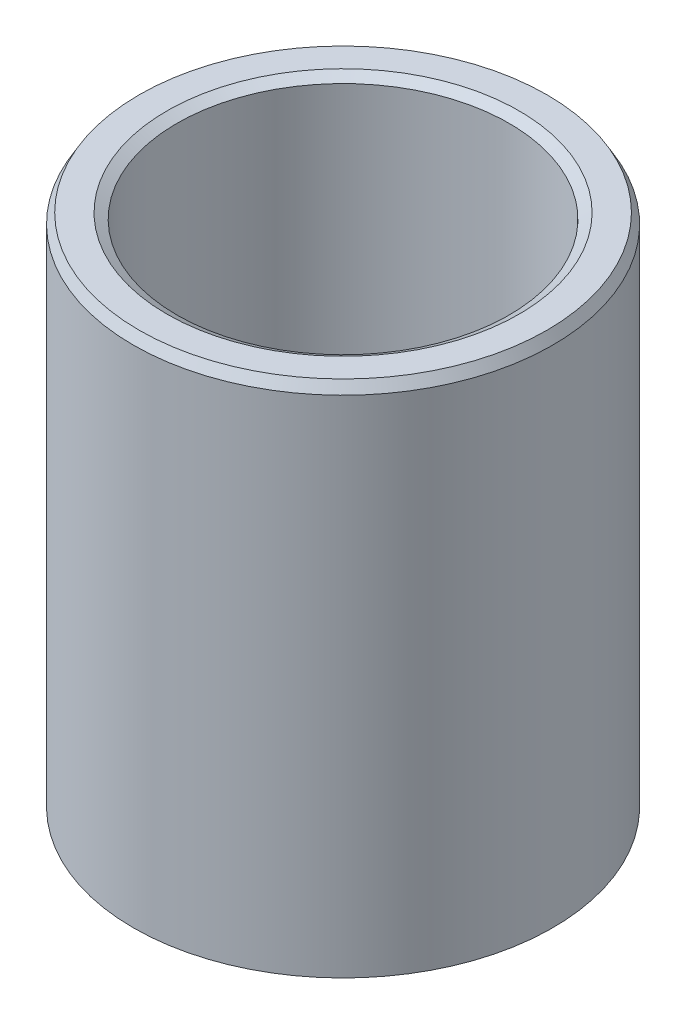
ISO-10303-21;
HEADER;
FILE_DESCRIPTION(('STEP AP214'),'2;1');
FILE_NAME('part.step','',(''),(''),'','','');
FILE_SCHEMA(('AUTOMOTIVE_DESIGN { 1 0 10303 214 1 1 1 1 }'));
ENDSEC;
DATA;
#1=APPLICATION_CONTEXT('core data for automotive mechanical design processes');
#2=APPLICATION_PROTOCOL_DEFINITION('international standard','automotive_design',2000,#1);
#3=PRODUCT_CONTEXT('',#1,'mechanical');
#4=PRODUCT('Part','Part','',(#3));
#5=PRODUCT_RELATED_PRODUCT_CATEGORY('part','',(#4));
#6=PRODUCT_DEFINITION_FORMATION('','',#4);
#7=PRODUCT_DEFINITION_CONTEXT('part definition',#1,'design');
#8=PRODUCT_DEFINITION('design','',#6,#7);
#9=PRODUCT_DEFINITION_SHAPE('','',#8);
#10=(LENGTH_UNIT() NAMED_UNIT(*) SI_UNIT(.MILLI.,.METRE.));
#11=(NAMED_UNIT(*) PLANE_ANGLE_UNIT() SI_UNIT($,.RADIAN.));
#12=(NAMED_UNIT(*) SI_UNIT($,.STERADIAN.) SOLID_ANGLE_UNIT());
#13=UNCERTAINTY_MEASURE_WITH_UNIT(LENGTH_MEASURE(1.E-05),#10,'distance_accuracy_value','');
#14=(GEOMETRIC_REPRESENTATION_CONTEXT(3) GLOBAL_UNCERTAINTY_ASSIGNED_CONTEXT((#13)) GLOBAL_UNIT_ASSIGNED_CONTEXT((#10,
#11,#12)) REPRESENTATION_CONTEXT('',''));
#15=CARTESIAN_POINT('',(0.,0.,0.));
#16=DIRECTION('',(0.,0.,1.));
#17=DIRECTION('',(1.,0.,0.));
#18=AXIS2_PLACEMENT_3D('',#15,#16,#17);
#19=CARTESIAN_POINT('',(0.,43.4328632835127,0.));
#20=DIRECTION('',(0.,-1.,0.));
#21=DIRECTION('',(0.,0.,-1.));
#22=AXIS2_PLACEMENT_3D('',#19,#20,#21);
#23=CYLINDRICAL_SURFACE('',#22,17.5);
#24=CARTESIAN_POINT('',(0.,0.482095603221468,0.));
#25=DIRECTION('',(0.,1.,0.));
#26=DIRECTION('',(0.,0.,1.));
#27=AXIS2_PLACEMENT_3D('',#24,#25,#26);
#28=CIRCLE('',#27,17.5);
#29=CARTESIAN_POINT('',(0.,0.482095603221468,17.5));
#30=VERTEX_POINT('',#29);
#31=EDGE_CURVE('E10',#30,#30,#28,.T.);
#32=ORIENTED_EDGE('',*,*,#31,.T.);
#33=EDGE_LOOP('',(#32));
#34=FACE_BOUND('',#33,.T.);
#35=CARTESIAN_POINT('',(0.,42.5978492046275,0.));
#36=DIRECTION('',(0.,1.,0.));
#37=DIRECTION('',(0.,0.,1.));
#38=AXIS2_PLACEMENT_3D('',#35,#36,#37);
#39=CIRCLE('',#38,17.5);
#40=CARTESIAN_POINT('',(0.,42.5978492046275,17.5));
#41=VERTEX_POINT('',#40);
#42=EDGE_CURVE('E50',#41,#41,#39,.F.);
#43=ORIENTED_EDGE('',*,*,#42,.T.);
#44=EDGE_LOOP('',(#43));
#45=FACE_BOUND('',#44,.T.);
#46=ADVANCED_FACE('F39',(#34,#45),#23,.T.);
#47=CARTESIAN_POINT('',(0.,43.4328632835127,0.));
#48=DIRECTION('',(0.,1.,0.));
#49=DIRECTION('',(0.,0.,1.));
#50=AXIS2_PLACEMENT_3D('',#47,#48,#49);
#51=PLANE('',#50);
#52=CARTESIAN_POINT('',(0.,43.4328632835127,0.));
#53=DIRECTION('',(0.,1.,0.));
#54=DIRECTION('',(0.,0.,1.));
#55=AXIS2_PLACEMENT_3D('',#52,#53,#54);
#56=CIRCLE('',#55,14.6968770817173);
#57=CARTESIAN_POINT('',(0.,43.4328632835127,14.6968770817173));
#58=VERTEX_POINT('',#57);
#59=EDGE_CURVE('E58',#58,#58,#56,.F.);
#60=ORIENTED_EDGE('',*,*,#59,.T.);
#61=EDGE_LOOP('',(#60));
#62=FACE_BOUND('',#61,.T.);
#63=CARTESIAN_POINT('',(0.,43.4328632835127,0.));
#64=DIRECTION('',(0.,1.,0.));
#65=DIRECTION('',(0.,0.,1.));
#66=AXIS2_PLACEMENT_3D('',#63,#64,#65);
#67=CIRCLE('',#66,17.0179043967785);
#68=CARTESIAN_POINT('',(0.,43.4328632835127,17.0179043967785));
#69=VERTEX_POINT('',#68);
#70=EDGE_CURVE('E61',#69,#69,#67,.T.);
#71=ORIENTED_EDGE('',*,*,#70,.T.);
#72=EDGE_LOOP('',(#71));
#73=FACE_BOUND('',#72,.T.);
#74=ADVANCED_FACE('F88',(#62,#73),#51,.T.);
#75=CARTESIAN_POINT('',(0.,0.,0.));
#76=DIRECTION('',(0.,1.,0.));
#77=DIRECTION('',(0.,0.,1.));
#78=AXIS2_PLACEMENT_3D('',#75,#76,#77);
#79=PLANE('',#78);
#80=CARTESIAN_POINT('',(0.,0.,0.));
#81=DIRECTION('',(0.,1.,0.));
#82=DIRECTION('',(0.,0.,1.));
#83=AXIS2_PLACEMENT_3D('',#80,#81,#82);
#84=CIRCLE('',#83,14.3439586060536);
#85=CARTESIAN_POINT('',(0.,0.,14.3439586060536));
#86=VERTEX_POINT('',#85);
#87=EDGE_CURVE('E51',#86,#86,#84,.T.);
#88=ORIENTED_EDGE('',*,*,#87,.T.);
#89=EDGE_LOOP('',(#88));
#90=FACE_BOUND('',#89,.T.);
#91=CARTESIAN_POINT('',(0.,0.,0.));
#92=DIRECTION('',(0.,1.,0.));
#93=DIRECTION('',(0.,0.,1.));
#94=AXIS2_PLACEMENT_3D('',#91,#92,#93);
#95=CIRCLE('',#94,16.6649859211149);
#96=CARTESIAN_POINT('',(0.,0.,16.6649859211149));
#97=VERTEX_POINT('',#96);
#98=EDGE_CURVE('E54',#97,#97,#95,.F.);
#99=ORIENTED_EDGE('',*,*,#98,.T.);
#100=EDGE_LOOP('',(#99));
#101=FACE_BOUND('',#100,.T.);
#102=ADVANCED_FACE('F83',(#90,#101),#79,.F.);
#103=CARTESIAN_POINT('',(0.,43.4328632835127,0.));
#104=DIRECTION('',(0.,-1.,0.));
#105=DIRECTION('',(0.,0.,-1.));
#106=AXIS2_PLACEMENT_3D('',#103,#104,#105);
#107=CYLINDRICAL_SURFACE('',#106,13.8618630028321);
#108=CARTESIAN_POINT('',(0.,42.9507676802912,0.));
#109=DIRECTION('',(0.,1.,0.));
#110=DIRECTION('',(0.,0.,1.));
#111=AXIS2_PLACEMENT_3D('',#108,#109,#110);
#112=CIRCLE('',#111,13.8618630028321);
#113=CARTESIAN_POINT('',(0.,42.9507676802912,13.8618630028321));
#114=VERTEX_POINT('',#113);
#115=EDGE_CURVE('E67',#114,#114,#112,.T.);
#116=ORIENTED_EDGE('',*,*,#115,.T.);
#117=EDGE_LOOP('',(#116));
#118=FACE_BOUND('',#117,.T.);
#119=CARTESIAN_POINT('',(0.,0.835014078885157,0.));
#120=DIRECTION('',(0.,1.,0.));
#121=DIRECTION('',(0.,0.,1.));
#122=AXIS2_PLACEMENT_3D('',#119,#120,#121);
#123=CIRCLE('',#122,13.8618630028321);
#124=CARTESIAN_POINT('',(0.,0.835014078885157,13.8618630028321));
#125=VERTEX_POINT('',#124);
#126=EDGE_CURVE('E69',#125,#125,#123,.F.);
#127=ORIENTED_EDGE('',*,*,#126,.T.);
#128=EDGE_LOOP('',(#127));
#129=FACE_BOUND('',#128,.T.);
#130=ADVANCED_FACE('F71',(#118,#129),#107,.F.);
#131=CARTESIAN_POINT('',(0.,42.9507676802912,0.));
#132=DIRECTION('',(0.,1.,0.));
#133=DIRECTION('',(0.,0.,1.));
#134=AXIS2_PLACEMENT_3D('',#131,#132,#133);
#135=CONICAL_SURFACE('',#134,13.8618630028321,1.04719755119659);
#136=ORIENTED_EDGE('',*,*,#59,.F.);
#137=EDGE_LOOP('',(#136));
#138=FACE_BOUND('',#137,.T.);
#139=ORIENTED_EDGE('',*,*,#115,.F.);
#140=EDGE_LOOP('',(#139));
#141=FACE_BOUND('',#140,.T.);
#142=ADVANCED_FACE('F77',(#138,#141),#135,.F.);
#143=CARTESIAN_POINT('',(0.,0.,0.));
#144=DIRECTION('',(0.,-1.,0.));
#145=DIRECTION('',(0.,0.,-1.));
#146=AXIS2_PLACEMENT_3D('',#143,#144,#145);
#147=CONICAL_SURFACE('',#146,14.3439586060536,0.523598775598297);
#148=ORIENTED_EDGE('',*,*,#126,.F.);
#149=EDGE_LOOP('',(#148));
#150=FACE_BOUND('',#149,.T.);
#151=ORIENTED_EDGE('',*,*,#87,.F.);
#152=EDGE_LOOP('',(#151));
#153=FACE_BOUND('',#152,.T.);
#154=ADVANCED_FACE('F73',(#150,#153),#147,.F.);
#155=CARTESIAN_POINT('',(0.,0.482095603221468,0.));
#156=DIRECTION('',(0.,1.,0.));
#157=DIRECTION('',(0.,0.,1.));
#158=AXIS2_PLACEMENT_3D('',#155,#156,#157);
#159=CONICAL_SURFACE('',#158,17.5,1.0471975511966);
#160=ORIENTED_EDGE('',*,*,#98,.F.);
#161=EDGE_LOOP('',(#160));
#162=FACE_BOUND('',#161,.T.);
#163=ORIENTED_EDGE('',*,*,#31,.F.);
#164=EDGE_LOOP('',(#163));
#165=FACE_BOUND('',#164,.T.);
#166=ADVANCED_FACE('F76',(#162,#165),#159,.T.);
#167=CARTESIAN_POINT('',(0.,43.4328632835127,0.));
#168=DIRECTION('',(0.,-1.,0.));
#169=DIRECTION('',(0.,0.,-1.));
#170=AXIS2_PLACEMENT_3D('',#167,#168,#169);
#171=CONICAL_SURFACE('',#170,17.0179043967785,0.523598775598291);
#172=ORIENTED_EDGE('',*,*,#42,.F.);
#173=EDGE_LOOP('',(#172));
#174=FACE_BOUND('',#173,.T.);
#175=ORIENTED_EDGE('',*,*,#70,.F.);
#176=EDGE_LOOP('',(#175));
#177=FACE_BOUND('',#176,.T.);
#178=ADVANCED_FACE('F45',(#174,#177),#171,.T.);
#179=CLOSED_SHELL('',(#46,#74,#102,#130,#142,#154,#166,#178));
#180=MANIFOLD_SOLID_BREP('B2',#179);
#181=ADVANCED_BREP_SHAPE_REPRESENTATION('',(#18,#180),#14);
#182=SHAPE_DEFINITION_REPRESENTATION(#9,#181);
ENDSEC;
END-ISO-10303-21;
